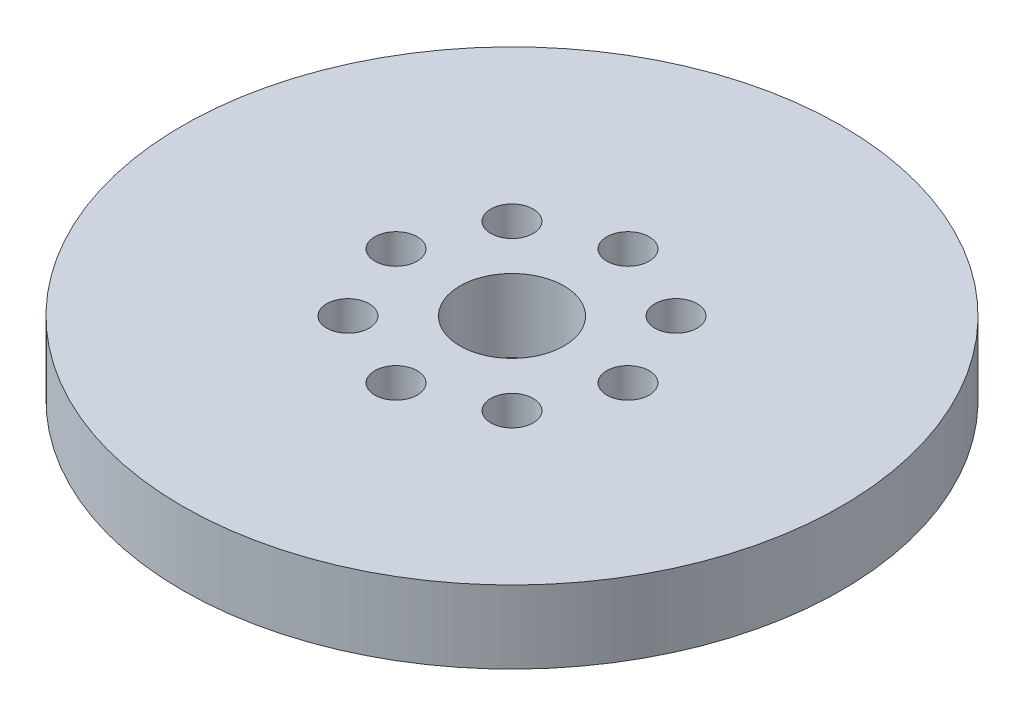
ISO-10303-21;
HEADER;
FILE_DESCRIPTION(('STEP AP214'),'2;1');
FILE_NAME('part.step','',(''),(''),'','','');
FILE_SCHEMA(('AUTOMOTIVE_DESIGN { 1 0 10303 214 1 1 1 1 }'));
ENDSEC;
DATA;
#1=APPLICATION_CONTEXT('core data for automotive mechanical design processes');
#2=APPLICATION_PROTOCOL_DEFINITION('international standard','automotive_design',2000,#1);
#3=PRODUCT_CONTEXT('',#1,'mechanical');
#4=PRODUCT('Part','Part','',(#3));
#5=PRODUCT_RELATED_PRODUCT_CATEGORY('part','',(#4));
#6=PRODUCT_DEFINITION_FORMATION('','',#4);
#7=PRODUCT_DEFINITION_CONTEXT('part definition',#1,'design');
#8=PRODUCT_DEFINITION('design','',#6,#7);
#9=PRODUCT_DEFINITION_SHAPE('','',#8);
#10=(LENGTH_UNIT() NAMED_UNIT(*) SI_UNIT(.MILLI.,.METRE.));
#11=(NAMED_UNIT(*) PLANE_ANGLE_UNIT() SI_UNIT($,.RADIAN.));
#12=(NAMED_UNIT(*) SI_UNIT($,.STERADIAN.) SOLID_ANGLE_UNIT());
#13=UNCERTAINTY_MEASURE_WITH_UNIT(LENGTH_MEASURE(1.E-05),#10,'distance_accuracy_value','');
#14=(GEOMETRIC_REPRESENTATION_CONTEXT(3) GLOBAL_UNCERTAINTY_ASSIGNED_CONTEXT((#13)) GLOBAL_UNIT_ASSIGNED_CONTEXT((#10,
#11,#12)) REPRESENTATION_CONTEXT('',''));
#15=CARTESIAN_POINT('',(0.,0.,0.));
#16=DIRECTION('',(0.,0.,1.));
#17=DIRECTION('',(1.,0.,0.));
#18=AXIS2_PLACEMENT_3D('',#15,#16,#17);
#19=CARTESIAN_POINT('',(0.,21.,0.));
#20=DIRECTION('',(0.,-1.,0.));
#21=DIRECTION('',(0.,0.,-1.));
#22=AXIS2_PLACEMENT_3D('',#19,#20,#21);
#23=CYLINDRICAL_SURFACE('',#22,95.);
#24=CARTESIAN_POINT('',(0.,21.,0.));
#25=DIRECTION('',(0.,1.,0.));
#26=DIRECTION('',(0.,0.,1.));
#27=AXIS2_PLACEMENT_3D('',#24,#25,#26);
#28=CIRCLE('',#27,95.);
#29=CARTESIAN_POINT('',(0.,21.,-95.));
#30=VERTEX_POINT('',#29);
#31=EDGE_CURVE('E10',#30,#30,#28,.T.);
#32=CARTESIAN_POINT('',(0.,0.,0.));
#33=DIRECTION('',(0.,1.,0.));
#34=DIRECTION('',(0.,0.,1.));
#35=AXIS2_PLACEMENT_3D('',#32,#33,#34);
#36=CIRCLE('',#35,95.);
#37=CARTESIAN_POINT('',(0.,0.,-95.));
#38=VERTEX_POINT('',#37);
#39=EDGE_CURVE('E37',#38,#38,#36,.T.);
#40=CARTESIAN_POINT('',(0.,21.,-95.));
#41=CARTESIAN_POINT('',(0.,20.78125,-95.));
#42=CARTESIAN_POINT('',(0.,20.5625,-95.));
#43=CARTESIAN_POINT('',(0.,20.125,-95.));
#44=CARTESIAN_POINT('',(0.,19.90625,-95.));
#45=CARTESIAN_POINT('',(0.,19.46875,-95.));
#46=CARTESIAN_POINT('',(0.,19.25,-95.));
#47=CARTESIAN_POINT('',(0.,18.8125,-95.));
#48=CARTESIAN_POINT('',(0.,18.59375,-95.));
#49=CARTESIAN_POINT('',(0.,18.15625,-95.));
#50=CARTESIAN_POINT('',(0.,17.9375,-95.));
#51=CARTESIAN_POINT('',(0.,17.5,-95.));
#52=CARTESIAN_POINT('',(0.,17.28125,-95.));
#53=CARTESIAN_POINT('',(0.,16.84375,-95.));
#54=CARTESIAN_POINT('',(0.,16.625,-95.));
#55=CARTESIAN_POINT('',(0.,16.1875,-95.));
#56=CARTESIAN_POINT('',(0.,15.96875,-95.));
#57=CARTESIAN_POINT('',(0.,15.53125,-95.));
#58=CARTESIAN_POINT('',(0.,15.3125,-95.));
#59=CARTESIAN_POINT('',(0.,14.875,-95.));
#60=CARTESIAN_POINT('',(0.,14.65625,-95.));
#61=CARTESIAN_POINT('',(0.,14.21875,-95.));
#62=CARTESIAN_POINT('',(0.,14.,-95.));
#63=CARTESIAN_POINT('',(0.,13.5625,-95.));
#64=CARTESIAN_POINT('',(0.,13.34375,-95.));
#65=CARTESIAN_POINT('',(0.,12.90625,-95.));
#66=CARTESIAN_POINT('',(0.,12.6875,-95.));
#67=CARTESIAN_POINT('',(0.,12.25,-95.));
#68=CARTESIAN_POINT('',(0.,12.03125,-95.));
#69=CARTESIAN_POINT('',(0.,11.59375,-95.));
#70=CARTESIAN_POINT('',(0.,11.375,-95.));
#71=CARTESIAN_POINT('',(0.,10.9375,-95.));
#72=CARTESIAN_POINT('',(0.,10.71875,-95.));
#73=CARTESIAN_POINT('',(0.,10.28125,-95.));
#74=CARTESIAN_POINT('',(0.,10.0625,-95.));
#75=CARTESIAN_POINT('',(0.,9.625,-95.));
#76=CARTESIAN_POINT('',(0.,9.40625,-95.));
#77=CARTESIAN_POINT('',(0.,8.96875,-95.));
#78=CARTESIAN_POINT('',(0.,8.75,-95.));
#79=CARTESIAN_POINT('',(0.,8.3125,-95.));
#80=CARTESIAN_POINT('',(0.,8.09375,-95.));
#81=CARTESIAN_POINT('',(0.,7.65625,-95.));
#82=CARTESIAN_POINT('',(0.,7.4375,-95.));
#83=CARTESIAN_POINT('',(0.,7.,-95.));
#84=CARTESIAN_POINT('',(0.,6.78125,-95.));
#85=CARTESIAN_POINT('',(0.,6.34375,-95.));
#86=CARTESIAN_POINT('',(0.,6.125,-95.));
#87=CARTESIAN_POINT('',(0.,5.6875,-95.));
#88=CARTESIAN_POINT('',(0.,5.46875,-95.));
#89=CARTESIAN_POINT('',(0.,5.03125,-95.));
#90=CARTESIAN_POINT('',(0.,4.8125,-95.));
#91=CARTESIAN_POINT('',(0.,4.375,-95.));
#92=CARTESIAN_POINT('',(0.,4.15625,-95.));
#93=CARTESIAN_POINT('',(0.,3.71875,-95.));
#94=CARTESIAN_POINT('',(0.,3.5,-95.));
#95=CARTESIAN_POINT('',(0.,3.0625,-95.));
#96=CARTESIAN_POINT('',(0.,2.84375,-95.));
#97=CARTESIAN_POINT('',(0.,2.40625,-95.));
#98=CARTESIAN_POINT('',(0.,2.1875,-95.));
#99=CARTESIAN_POINT('',(0.,1.75,-95.));
#100=CARTESIAN_POINT('',(0.,1.53125,-95.));
#101=CARTESIAN_POINT('',(0.,1.09375,-95.));
#102=CARTESIAN_POINT('',(0.,0.875000000000001,-95.));
#103=CARTESIAN_POINT('',(0.,0.4375,-95.));
#104=CARTESIAN_POINT('',(0.,0.21875,-95.));
#105=CARTESIAN_POINT('',(0.,0.,-95.));
#106=B_SPLINE_CURVE_WITH_KNOTS('',3,(#40,#41,#42,#43,#44,#45,#46,#47,#48,#49,#50,#51,#52,#53,
#54,#55,#56,#57,#58,#59,#60,#61,#62,#63,#64,#65,#66,#67,#68,#69,#70,#71,#72,#73,#74,#75,#76,#77,
#78,#79,#80,#81,#82,#83,#84,#85,#86,#87,#88,#89,#90,#91,#92,#93,#94,#95,#96,#97,#98,#99,#100,
#101,#102,#103,#104,#105),.UNSPECIFIED.,.F.,.F.,(4,2,2,2,2,2,2,2,2,2,2,2,2,2,2,2,2,2,2,2,2,2,2,
2,2,2,2,2,2,2,2,2,4),(0.,0.656249999999997,1.3125,1.96875,2.625,3.28125,3.9375,4.59375,5.25,
5.90625,6.5625,7.21875,7.875,8.53125,9.1875,9.84375,10.5,11.15625,11.8125,12.46875,13.125,
13.78125,14.4375,15.09375,15.75,16.40625,17.0625,17.71875,18.375,19.03125,19.6875,20.34375,21.),.UNSPECIFIED.);
#107=EDGE_CURVE('BSEAM40',#30,#38,#106,.T.);
#108=ORIENTED_EDGE('',*,*,#31,.F.);
#109=ORIENTED_EDGE('',*,*,#39,.T.);
#110=ORIENTED_EDGE('',*,*,#107,.T.);
#111=ORIENTED_EDGE('',*,*,#107,.F.);
#112=EDGE_LOOP('',(#108,#110,#109,#111));
#113=FACE_BOUND('',#112,.T.);
#114=ADVANCED_FACE('F40',(#113),#23,.T.);
#115=CARTESIAN_POINT('',(0.,21.,0.));
#116=DIRECTION('',(0.,1.,0.));
#117=DIRECTION('',(0.,0.,1.));
#118=AXIS2_PLACEMENT_3D('',#115,#116,#117);
#119=PLANE('',#118);
#120=CARTESIAN_POINT('',(1.16738619199147E-13,21.,33.4352694085505));
#121=DIRECTION('',(0.,1.,0.));
#122=DIRECTION('',(1.,0.,0.));
#123=AXIS2_PLACEMENT_3D('',#120,#121,#122);
#124=CIRCLE('',#123,6.11158981847237);
#125=CARTESIAN_POINT('',(6.11158981847248,21.,33.4352694085505));
#126=VERTEX_POINT('',#125);
#127=EDGE_CURVE('E88',#126,#126,#124,.T.);
#128=ORIENTED_EDGE('',*,*,#127,.F.);
#129=EDGE_LOOP('',(#128));
#130=FACE_BOUND('',#129,.T.);
#131=CARTESIAN_POINT('',(23.6423057295853,21.,23.642305729585));
#132=DIRECTION('',(0.,1.,0.));
#133=DIRECTION('',(0.707106781186544,0.,-0.707106781186551));
#134=AXIS2_PLACEMENT_3D('',#131,#132,#133);
#135=CIRCLE('',#134,6.11158981847237);
#136=CARTESIAN_POINT('',(27.9638523340577,21.,19.3207591251126));
#137=VERTEX_POINT('',#136);
#138=EDGE_CURVE('E79',#137,#137,#135,.T.);
#139=ORIENTED_EDGE('',*,*,#138,.F.);
#140=EDGE_LOOP('',(#139));
#141=FACE_BOUND('',#140,.T.);
#142=CARTESIAN_POINT('',(33.4352694085505,21.,0.));
#143=DIRECTION('',(0.,1.,0.));
#144=DIRECTION('',(0.,0.,-1.));
#145=AXIS2_PLACEMENT_3D('',#142,#143,#144);
#146=CIRCLE('',#145,6.11158981847237);
#147=CARTESIAN_POINT('',(33.4352694085505,21.,-6.11158981847237));
#148=VERTEX_POINT('',#147);
#149=EDGE_CURVE('E74',#148,#148,#146,.T.);
#150=ORIENTED_EDGE('',*,*,#149,.F.);
#151=EDGE_LOOP('',(#150));
#152=FACE_BOUND('',#151,.T.);
#153=CARTESIAN_POINT('',(23.642305729585,21.,-23.6423057295854));
#154=DIRECTION('',(0.,1.,0.));
#155=DIRECTION('',(-0.707106781186554,0.,-0.707106781186541));
#156=AXIS2_PLACEMENT_3D('',#153,#154,#155);
#157=CIRCLE('',#156,6.11158981847237);
#158=CARTESIAN_POINT('',(19.3207591251125,21.,-27.9638523340578));
#159=VERTEX_POINT('',#158);
#160=EDGE_CURVE('E70',#159,#159,#157,.T.);
#161=ORIENTED_EDGE('',*,*,#160,.F.);
#162=EDGE_LOOP('',(#161));
#163=FACE_BOUND('',#162,.T.);
#164=CARTESIAN_POINT('',(-3.5021585759744E-13,21.,-33.4352694085505));
#165=DIRECTION('',(0.,1.,0.));
#166=DIRECTION('',(-1.,0.,0.));
#167=AXIS2_PLACEMENT_3D('',#164,#165,#166);
#168=CIRCLE('',#167,6.11158981847237);
#169=CARTESIAN_POINT('',(-6.11158981847272,21.,-33.4352694085504));
#170=VERTEX_POINT('',#169);
#171=EDGE_CURVE('E100',#170,#170,#168,.T.);
#172=ORIENTED_EDGE('',*,*,#171,.F.);
#173=EDGE_LOOP('',(#172));
#174=FACE_BOUND('',#173,.T.);
#175=CARTESIAN_POINT('',(-23.6423057295855,21.,-23.6423057295849));
#176=DIRECTION('',(0.,1.,0.));
#177=DIRECTION('',(-0.707106781186539,0.,0.707106781186556));
#178=AXIS2_PLACEMENT_3D('',#175,#176,#177);
#179=CIRCLE('',#178,6.11158981847237);
#180=CARTESIAN_POINT('',(-27.9638523340579,21.,-19.3207591251124));
#181=VERTEX_POINT('',#180);
#182=EDGE_CURVE('E93',#181,#181,#179,.T.);
#183=ORIENTED_EDGE('',*,*,#182,.F.);
#184=EDGE_LOOP('',(#183));
#185=FACE_BOUND('',#184,.T.);
#186=CARTESIAN_POINT('',(-23.6423057295851,21.,23.6423057295852));
#187=DIRECTION('',(0.,1.,0.));
#188=DIRECTION('',(0.707106781186549,0.,0.707106781186546));
#189=AXIS2_PLACEMENT_3D('',#186,#187,#188);
#190=CIRCLE('',#189,6.11158981847237);
#191=CARTESIAN_POINT('',(-19.3207591251127,21.,27.9638523340577));
#192=VERTEX_POINT('',#191);
#193=EDGE_CURVE('E61',#192,#192,#190,.T.);
#194=ORIENTED_EDGE('',*,*,#193,.F.);
#195=EDGE_LOOP('',(#194));
#196=FACE_BOUND('',#195,.T.);
#197=CARTESIAN_POINT('',(-33.4352694085505,21.,0.));
#198=DIRECTION('',(0.,1.,0.));
#199=DIRECTION('',(0.,0.,1.));
#200=AXIS2_PLACEMENT_3D('',#197,#198,#199);
#201=CIRCLE('',#200,6.11158981847237);
#202=CARTESIAN_POINT('',(-33.4352694085505,21.,6.11158981847237));
#203=VERTEX_POINT('',#202);
#204=EDGE_CURVE('E54',#203,#203,#201,.T.);
#205=ORIENTED_EDGE('',*,*,#204,.F.);
#206=EDGE_LOOP('',(#205));
#207=FACE_BOUND('',#206,.T.);
#208=CARTESIAN_POINT('',(0.,21.,0.));
#209=DIRECTION('',(0.,1.,0.));
#210=DIRECTION('',(0.,0.,1.));
#211=AXIS2_PLACEMENT_3D('',#208,#209,#210);
#212=CIRCLE('',#211,15.);
#213=CARTESIAN_POINT('',(0.,21.,-15.));
#214=VERTEX_POINT('',#213);
#215=EDGE_CURVE('E50',#214,#214,#212,.T.);
#216=ORIENTED_EDGE('',*,*,#215,.F.);
#217=EDGE_LOOP('',(#216));
#218=FACE_BOUND('',#217,.T.);
#219=ORIENTED_EDGE('',*,*,#31,.T.);
#220=EDGE_LOOP('',(#219));
#221=FACE_BOUND('',#220,.T.);
#222=ADVANCED_FACE('F115',(#130,#141,#152,#163,#174,#185,#196,#207,#218,#221),#119,.T.);
#223=CARTESIAN_POINT('',(0.,0.,0.));
#224=DIRECTION('',(0.,1.,0.));
#225=DIRECTION('',(0.,0.,1.));
#226=AXIS2_PLACEMENT_3D('',#223,#224,#225);
#227=PLANE('',#226);
#228=CARTESIAN_POINT('',(0.,0.,0.));
#229=DIRECTION('',(0.,1.,0.));
#230=DIRECTION('',(0.,0.,1.));
#231=AXIS2_PLACEMENT_3D('',#228,#229,#230);
#232=CIRCLE('',#231,15.);
#233=CARTESIAN_POINT('',(0.,0.,-15.));
#234=VERTEX_POINT('',#233);
#235=EDGE_CURVE('E47',#234,#234,#232,.T.);
#236=ORIENTED_EDGE('',*,*,#235,.T.);
#237=EDGE_LOOP('',(#236));
#238=FACE_BOUND('',#237,.T.);
#239=ORIENTED_EDGE('',*,*,#39,.F.);
#240=EDGE_LOOP('',(#239));
#241=FACE_BOUND('',#240,.T.);
#242=ADVANCED_FACE('F113',(#238,#241),#227,.F.);
#243=CARTESIAN_POINT('',(0.,21.,0.));
#244=DIRECTION('',(0.,-1.,0.));
#245=DIRECTION('',(0.,0.,-1.));
#246=AXIS2_PLACEMENT_3D('',#243,#244,#245);
#247=CYLINDRICAL_SURFACE('',#246,15.);
#248=CARTESIAN_POINT('',(0.,21.,-15.));
#249=CARTESIAN_POINT('',(0.,20.78125,-15.));
#250=CARTESIAN_POINT('',(0.,20.5625,-15.));
#251=CARTESIAN_POINT('',(0.,20.125,-15.));
#252=CARTESIAN_POINT('',(0.,19.90625,-15.));
#253=CARTESIAN_POINT('',(0.,19.46875,-15.));
#254=CARTESIAN_POINT('',(0.,19.25,-15.));
#255=CARTESIAN_POINT('',(0.,18.8125,-15.));
#256=CARTESIAN_POINT('',(0.,18.59375,-15.));
#257=CARTESIAN_POINT('',(0.,18.15625,-15.));
#258=CARTESIAN_POINT('',(0.,17.9375,-15.));
#259=CARTESIAN_POINT('',(0.,17.5,-15.));
#260=CARTESIAN_POINT('',(0.,17.28125,-15.));
#261=CARTESIAN_POINT('',(0.,16.84375,-15.));
#262=CARTESIAN_POINT('',(0.,16.625,-15.));
#263=CARTESIAN_POINT('',(0.,16.1875,-15.));
#264=CARTESIAN_POINT('',(0.,15.96875,-15.));
#265=CARTESIAN_POINT('',(0.,15.53125,-15.));
#266=CARTESIAN_POINT('',(0.,15.3125,-15.));
#267=CARTESIAN_POINT('',(0.,14.875,-15.));
#268=CARTESIAN_POINT('',(0.,14.65625,-15.));
#269=CARTESIAN_POINT('',(0.,14.21875,-15.));
#270=CARTESIAN_POINT('',(0.,14.,-15.));
#271=CARTESIAN_POINT('',(0.,13.5625,-15.));
#272=CARTESIAN_POINT('',(0.,13.34375,-15.));
#273=CARTESIAN_POINT('',(0.,12.90625,-15.));
#274=CARTESIAN_POINT('',(0.,12.6875,-15.));
#275=CARTESIAN_POINT('',(0.,12.25,-15.));
#276=CARTESIAN_POINT('',(0.,12.03125,-15.));
#277=CARTESIAN_POINT('',(0.,11.59375,-15.));
#278=CARTESIAN_POINT('',(0.,11.375,-15.));
#279=CARTESIAN_POINT('',(0.,10.9375,-15.));
#280=CARTESIAN_POINT('',(0.,10.71875,-15.));
#281=CARTESIAN_POINT('',(0.,10.28125,-15.));
#282=CARTESIAN_POINT('',(0.,10.0625,-15.));
#283=CARTESIAN_POINT('',(0.,9.625,-15.));
#284=CARTESIAN_POINT('',(0.,9.40625,-15.));
#285=CARTESIAN_POINT('',(0.,8.96875,-15.));
#286=CARTESIAN_POINT('',(0.,8.75,-15.));
#287=CARTESIAN_POINT('',(0.,8.3125,-15.));
#288=CARTESIAN_POINT('',(0.,8.09375,-15.));
#289=CARTESIAN_POINT('',(0.,7.65625,-15.));
#290=CARTESIAN_POINT('',(0.,7.4375,-15.));
#291=CARTESIAN_POINT('',(0.,7.,-15.));
#292=CARTESIAN_POINT('',(0.,6.78125,-15.));
#293=CARTESIAN_POINT('',(0.,6.34375,-15.));
#294=CARTESIAN_POINT('',(0.,6.125,-15.));
#295=CARTESIAN_POINT('',(0.,5.6875,-15.));
#296=CARTESIAN_POINT('',(0.,5.46875,-15.));
#297=CARTESIAN_POINT('',(0.,5.03125,-15.));
#298=CARTESIAN_POINT('',(0.,4.8125,-15.));
#299=CARTESIAN_POINT('',(0.,4.375,-15.));
#300=CARTESIAN_POINT('',(0.,4.15625,-15.));
#301=CARTESIAN_POINT('',(0.,3.71875,-15.));
#302=CARTESIAN_POINT('',(0.,3.5,-15.));
#303=CARTESIAN_POINT('',(0.,3.0625,-15.));
#304=CARTESIAN_POINT('',(0.,2.84375,-15.));
#305=CARTESIAN_POINT('',(0.,2.40625,-15.));
#306=CARTESIAN_POINT('',(0.,2.1875,-15.));
#307=CARTESIAN_POINT('',(0.,1.75,-15.));
#308=CARTESIAN_POINT('',(0.,1.53125,-15.));
#309=CARTESIAN_POINT('',(0.,1.09375,-15.));
#310=CARTESIAN_POINT('',(0.,0.875000000000001,-15.));
#311=CARTESIAN_POINT('',(0.,0.4375,-15.));
#312=CARTESIAN_POINT('',(0.,0.21875,-15.));
#313=CARTESIAN_POINT('',(0.,0.,-15.));
#314=B_SPLINE_CURVE_WITH_KNOTS('',3,(#248,#249,#250,#251,#252,#253,#254,#255,#256,#257,#258,
#259,#260,#261,#262,#263,#264,#265,#266,#267,#268,#269,#270,#271,#272,#273,#274,#275,#276,#277,
#278,#279,#280,#281,#282,#283,#284,#285,#286,#287,#288,#289,#290,#291,#292,#293,#294,#295,#296,
#297,#298,#299,#300,#301,#302,#303,#304,#305,#306,#307,#308,#309,#310,#311,#312,#313),
.UNSPECIFIED.,.F.,.F.,(4,2,2,2,2,2,2,2,2,2,2,2,2,2,2,2,2,2,2,2,2,2,2,2,2,2,2,2,2,2,2,2,4),(0.,
0.656250000000001,1.3125,1.96875,2.625,3.28125,3.9375,4.59375,5.25,5.90625,6.5625,7.21875,7.875,
8.53125,9.1875,9.84375,10.5,11.15625,11.8125,12.46875,13.125,13.78125,14.4375,15.09375,15.75,
16.40625,17.0625,17.71875,18.375,19.03125,19.6875,20.34375,21.),.UNSPECIFIED.);
#315=EDGE_CURVE('BSEAM127',#214,#234,#314,.T.);
#316=ORIENTED_EDGE('',*,*,#215,.T.);
#317=ORIENTED_EDGE('',*,*,#235,.F.);
#318=ORIENTED_EDGE('',*,*,#315,.T.);
#319=ORIENTED_EDGE('',*,*,#315,.F.);
#320=EDGE_LOOP('',(#316,#318,#317,#319));
#321=FACE_BOUND('',#320,.T.);
#322=ADVANCED_FACE('F127',(#321),#247,.F.);
#323=CARTESIAN_POINT('',(-33.4352694085505,6.3604990840704,0.));
#324=DIRECTION('',(0.,1.,0.));
#325=DIRECTION('',(0.,0.,1.));
#326=AXIS2_PLACEMENT_3D('',#323,#324,#325);
#327=CYLINDRICAL_SURFACE('',#326,6.11158981847237);
#328=CARTESIAN_POINT('',(-33.4352694085505,6.3604990840704,0.));
#329=DIRECTION('',(0.,1.,0.));
#330=DIRECTION('',(0.,0.,1.));
#331=AXIS2_PLACEMENT_3D('',#328,#329,#330);
#332=CIRCLE('',#331,6.11158981847237);
#333=CARTESIAN_POINT('',(-33.4352694085505,6.3604990840704,6.11158981847237));
#334=VERTEX_POINT('',#333);
#335=EDGE_CURVE('E55',#334,#334,#332,.T.);
#336=ORIENTED_EDGE('',*,*,#335,.F.);
#337=EDGE_LOOP('',(#336));
#338=FACE_BOUND('',#337,.T.);
#339=ORIENTED_EDGE('',*,*,#204,.T.);
#340=EDGE_LOOP('',(#339));
#341=FACE_BOUND('',#340,.T.);
#342=ADVANCED_FACE('F129',(#338,#341),#327,.F.);
#343=CARTESIAN_POINT('',(-33.4352694085505,6.3604990840704,0.));
#344=DIRECTION('',(0.,1.,0.));
#345=DIRECTION('',(0.,0.,1.));
#346=AXIS2_PLACEMENT_3D('',#343,#344,#345);
#347=PLANE('',#346);
#348=ORIENTED_EDGE('',*,*,#335,.T.);
#349=EDGE_LOOP('',(#348));
#350=FACE_BOUND('',#349,.T.);
#351=ADVANCED_FACE('F157',(#350),#347,.T.);
#352=CARTESIAN_POINT('',(-23.6423057295851,6.3604990840704,23.6423057295852));
#353=DIRECTION('',(0.,1.,0.));
#354=DIRECTION('',(0.,0.,1.));
#355=AXIS2_PLACEMENT_3D('',#352,#353,#354);
#356=CYLINDRICAL_SURFACE('',#355,6.11158981847237);
#357=CARTESIAN_POINT('',(-23.6423057295851,6.3604990840704,23.6423057295852));
#358=DIRECTION('',(0.,1.,0.));
#359=DIRECTION('',(0.707106781186549,0.,0.707106781186546));
#360=AXIS2_PLACEMENT_3D('',#357,#358,#359);
#361=CIRCLE('',#360,6.11158981847237);
#362=CARTESIAN_POINT('',(-19.3207591251127,6.3604990840704,27.9638523340577));
#363=VERTEX_POINT('',#362);
#364=EDGE_CURVE('E59',#363,#363,#361,.T.);
#365=ORIENTED_EDGE('',*,*,#364,.F.);
#366=EDGE_LOOP('',(#365));
#367=FACE_BOUND('',#366,.T.);
#368=ORIENTED_EDGE('',*,*,#193,.T.);
#369=EDGE_LOOP('',(#368));
#370=FACE_BOUND('',#369,.T.);
#371=ADVANCED_FACE('F170',(#367,#370),#356,.F.);
#372=CARTESIAN_POINT('',(-23.6423057295851,6.3604990840704,23.6423057295852));
#373=DIRECTION('',(0.,1.,0.));
#374=DIRECTION('',(0.707106781186549,0.,0.707106781186546));
#375=AXIS2_PLACEMENT_3D('',#372,#373,#374);
#376=PLANE('',#375);
#377=ORIENTED_EDGE('',*,*,#364,.T.);
#378=EDGE_LOOP('',(#377));
#379=FACE_BOUND('',#378,.T.);
#380=ADVANCED_FACE('F182',(#379),#376,.T.);
#381=CARTESIAN_POINT('',(-23.6423057295855,6.3604990840704,-23.6423057295849));
#382=DIRECTION('',(0.,1.,0.));
#383=DIRECTION('',(0.,0.,1.));
#384=AXIS2_PLACEMENT_3D('',#381,#382,#383);
#385=CYLINDRICAL_SURFACE('',#384,6.11158981847237);
#386=CARTESIAN_POINT('',(-23.6423057295855,6.3604990840704,-23.6423057295849));
#387=DIRECTION('',(0.,1.,0.));
#388=DIRECTION('',(-0.707106781186539,0.,0.707106781186556));
#389=AXIS2_PLACEMENT_3D('',#386,#387,#388);
#390=CIRCLE('',#389,6.11158981847237);
#391=CARTESIAN_POINT('',(-27.9638523340579,6.3604990840704,-19.3207591251124));
#392=VERTEX_POINT('',#391);
#393=EDGE_CURVE('E94',#392,#392,#390,.T.);
#394=ORIENTED_EDGE('',*,*,#393,.F.);
#395=EDGE_LOOP('',(#394));
#396=FACE_BOUND('',#395,.T.);
#397=ORIENTED_EDGE('',*,*,#182,.T.);
#398=EDGE_LOOP('',(#397));
#399=FACE_BOUND('',#398,.T.);
#400=ADVANCED_FACE('F189',(#396,#399),#385,.F.);
#401=CARTESIAN_POINT('',(-23.6423057295855,6.3604990840704,-23.6423057295849));
#402=DIRECTION('',(0.,1.,0.));
#403=DIRECTION('',(-0.707106781186539,0.,0.707106781186556));
#404=AXIS2_PLACEMENT_3D('',#401,#402,#403);
#405=PLANE('',#404);
#406=ORIENTED_EDGE('',*,*,#393,.T.);
#407=EDGE_LOOP('',(#406));
#408=FACE_BOUND('',#407,.T.);
#409=ADVANCED_FACE('F107',(#408),#405,.T.);
#410=CARTESIAN_POINT('',(-3.5021585759744E-13,6.3604990840704,-33.4352694085505));
#411=DIRECTION('',(0.,1.,0.));
#412=DIRECTION('',(0.,0.,1.));
#413=AXIS2_PLACEMENT_3D('',#410,#411,#412);
#414=CYLINDRICAL_SURFACE('',#413,6.11158981847237);
#415=CARTESIAN_POINT('',(-3.5021585759744E-13,6.3604990840704,-33.4352694085505));
#416=DIRECTION('',(0.,1.,0.));
#417=DIRECTION('',(-1.,0.,0.));
#418=AXIS2_PLACEMENT_3D('',#415,#416,#417);
#419=CIRCLE('',#418,6.11158981847237);
#420=CARTESIAN_POINT('',(-6.11158981847272,6.3604990840704,-33.4352694085504));
#421=VERTEX_POINT('',#420);
#422=EDGE_CURVE('E72',#421,#421,#419,.T.);
#423=ORIENTED_EDGE('',*,*,#422,.F.);
#424=EDGE_LOOP('',(#423));
#425=FACE_BOUND('',#424,.T.);
#426=ORIENTED_EDGE('',*,*,#171,.T.);
#427=EDGE_LOOP('',(#426));
#428=FACE_BOUND('',#427,.T.);
#429=ADVANCED_FACE('F104',(#425,#428),#414,.F.);
#430=CARTESIAN_POINT('',(-3.5021585759744E-13,6.3604990840704,-33.4352694085505));
#431=DIRECTION('',(0.,1.,0.));
#432=DIRECTION('',(-1.,0.,0.));
#433=AXIS2_PLACEMENT_3D('',#430,#431,#432);
#434=PLANE('',#433);
#435=ORIENTED_EDGE('',*,*,#422,.T.);
#436=EDGE_LOOP('',(#435));
#437=FACE_BOUND('',#436,.T.);
#438=ADVANCED_FACE('F103',(#437),#434,.T.);
#439=CARTESIAN_POINT('',(23.642305729585,6.3604990840704,-23.6423057295854));
#440=DIRECTION('',(0.,1.,0.));
#441=DIRECTION('',(0.,0.,1.));
#442=AXIS2_PLACEMENT_3D('',#439,#440,#441);
#443=CYLINDRICAL_SURFACE('',#442,6.11158981847237);
#444=CARTESIAN_POINT('',(23.642305729585,6.3604990840704,-23.6423057295854));
#445=DIRECTION('',(0.,1.,0.));
#446=DIRECTION('',(-0.707106781186554,0.,-0.707106781186541));
#447=AXIS2_PLACEMENT_3D('',#444,#445,#446);
#448=CIRCLE('',#447,6.11158981847237);
#449=CARTESIAN_POINT('',(19.3207591251125,6.3604990840704,-27.9638523340578));
#450=VERTEX_POINT('',#449);
#451=EDGE_CURVE('E69',#450,#450,#448,.T.);
#452=ORIENTED_EDGE('',*,*,#451,.F.);
#453=EDGE_LOOP('',(#452));
#454=FACE_BOUND('',#453,.T.);
#455=ORIENTED_EDGE('',*,*,#160,.T.);
#456=EDGE_LOOP('',(#455));
#457=FACE_BOUND('',#456,.T.);
#458=ADVANCED_FACE('F219',(#454,#457),#443,.F.);
#459=CARTESIAN_POINT('',(23.642305729585,6.3604990840704,-23.6423057295854));
#460=DIRECTION('',(0.,1.,0.));
#461=DIRECTION('',(-0.707106781186554,0.,-0.707106781186541));
#462=AXIS2_PLACEMENT_3D('',#459,#460,#461);
#463=PLANE('',#462);
#464=ORIENTED_EDGE('',*,*,#451,.T.);
#465=EDGE_LOOP('',(#464));
#466=FACE_BOUND('',#465,.T.);
#467=ADVANCED_FACE('F227',(#466),#463,.T.);
#468=CARTESIAN_POINT('',(33.4352694085505,6.3604990840704,0.));
#469=DIRECTION('',(0.,1.,0.));
#470=DIRECTION('',(0.,0.,1.));
#471=AXIS2_PLACEMENT_3D('',#468,#469,#470);
#472=CYLINDRICAL_SURFACE('',#471,6.11158981847237);
#473=CARTESIAN_POINT('',(33.4352694085505,6.3604990840704,0.));
#474=DIRECTION('',(0.,1.,0.));
#475=DIRECTION('',(0.,0.,-1.));
#476=AXIS2_PLACEMENT_3D('',#473,#474,#475);
#477=CIRCLE('',#476,6.11158981847237);
#478=CARTESIAN_POINT('',(33.4352694085505,6.3604990840704,-6.11158981847237));
#479=VERTEX_POINT('',#478);
#480=EDGE_CURVE('E80',#479,#479,#477,.T.);
#481=ORIENTED_EDGE('',*,*,#480,.F.);
#482=EDGE_LOOP('',(#481));
#483=FACE_BOUND('',#482,.T.);
#484=ORIENTED_EDGE('',*,*,#149,.T.);
#485=EDGE_LOOP('',(#484));
#486=FACE_BOUND('',#485,.T.);
#487=ADVANCED_FACE('F240',(#483,#486),#472,.F.);
#488=CARTESIAN_POINT('',(33.4352694085505,6.3604990840704,0.));
#489=DIRECTION('',(0.,1.,0.));
#490=DIRECTION('',(0.,0.,-1.));
#491=AXIS2_PLACEMENT_3D('',#488,#489,#490);
#492=PLANE('',#491);
#493=ORIENTED_EDGE('',*,*,#480,.T.);
#494=EDGE_LOOP('',(#493));
#495=FACE_BOUND('',#494,.T.);
#496=ADVANCED_FACE('F246',(#495),#492,.T.);
#497=CARTESIAN_POINT('',(23.6423057295853,6.3604990840704,23.642305729585));
#498=DIRECTION('',(0.,1.,0.));
#499=DIRECTION('',(0.,0.,1.));
#500=AXIS2_PLACEMENT_3D('',#497,#498,#499);
#501=CYLINDRICAL_SURFACE('',#500,6.11158981847237);
#502=CARTESIAN_POINT('',(23.6423057295853,6.3604990840704,23.642305729585));
#503=DIRECTION('',(0.,1.,0.));
#504=DIRECTION('',(0.707106781186544,0.,-0.707106781186551));
#505=AXIS2_PLACEMENT_3D('',#502,#503,#504);
#506=CIRCLE('',#505,6.11158981847237);
#507=CARTESIAN_POINT('',(27.9638523340577,6.3604990840704,19.3207591251126));
#508=VERTEX_POINT('',#507);
#509=EDGE_CURVE('E82',#508,#508,#506,.T.);
#510=ORIENTED_EDGE('',*,*,#509,.F.);
#511=EDGE_LOOP('',(#510));
#512=FACE_BOUND('',#511,.T.);
#513=ORIENTED_EDGE('',*,*,#138,.T.);
#514=EDGE_LOOP('',(#513));
#515=FACE_BOUND('',#514,.T.);
#516=ADVANCED_FACE('F254',(#512,#515),#501,.F.);
#517=CARTESIAN_POINT('',(23.6423057295853,6.3604990840704,23.642305729585));
#518=DIRECTION('',(0.,1.,0.));
#519=DIRECTION('',(0.707106781186544,0.,-0.707106781186551));
#520=AXIS2_PLACEMENT_3D('',#517,#518,#519);
#521=PLANE('',#520);
#522=ORIENTED_EDGE('',*,*,#509,.T.);
#523=EDGE_LOOP('',(#522));
#524=FACE_BOUND('',#523,.T.);
#525=ADVANCED_FACE('F262',(#524),#521,.T.);
#526=CARTESIAN_POINT('',(1.16738619199147E-13,6.3604990840704,33.4352694085505));
#527=DIRECTION('',(0.,1.,0.));
#528=DIRECTION('',(0.,0.,1.));
#529=AXIS2_PLACEMENT_3D('',#526,#527,#528);
#530=CYLINDRICAL_SURFACE('',#529,6.11158981847237);
#531=CARTESIAN_POINT('',(1.16738619199147E-13,6.3604990840704,33.4352694085505));
#532=DIRECTION('',(0.,1.,0.));
#533=DIRECTION('',(1.,0.,0.));
#534=AXIS2_PLACEMENT_3D('',#531,#532,#533);
#535=CIRCLE('',#534,6.11158981847237);
#536=CARTESIAN_POINT('',(6.11158981847248,6.3604990840704,33.4352694085505));
#537=VERTEX_POINT('',#536);
#538=EDGE_CURVE('E63',#537,#537,#535,.T.);
#539=ORIENTED_EDGE('',*,*,#538,.F.);
#540=EDGE_LOOP('',(#539));
#541=FACE_BOUND('',#540,.T.);
#542=ORIENTED_EDGE('',*,*,#127,.T.);
#543=EDGE_LOOP('',(#542));
#544=FACE_BOUND('',#543,.T.);
#545=ADVANCED_FACE('F272',(#541,#544),#530,.F.);
#546=CARTESIAN_POINT('',(1.16738619199147E-13,6.3604990840704,33.4352694085505));
#547=DIRECTION('',(0.,1.,0.));
#548=DIRECTION('',(1.,0.,0.));
#549=AXIS2_PLACEMENT_3D('',#546,#547,#548);
#550=PLANE('',#549);
#551=ORIENTED_EDGE('',*,*,#538,.T.);
#552=EDGE_LOOP('',(#551));
#553=FACE_BOUND('',#552,.T.);
#554=ADVANCED_FACE('F285',(#553),#550,.T.);
#555=CLOSED_SHELL('',(#114,#222,#242,#322,#342,#351,#371,#380,#400,#409,#429,#438,#458,#467,
#487,#496,#516,#525,#545,#554));
#556=MANIFOLD_SOLID_BREP('B2',#555);
#557=ADVANCED_BREP_SHAPE_REPRESENTATION('',(#18,#556),#14);
#558=SHAPE_DEFINITION_REPRESENTATION(#9,#557);
ENDSEC;
END-ISO-10303-21;
